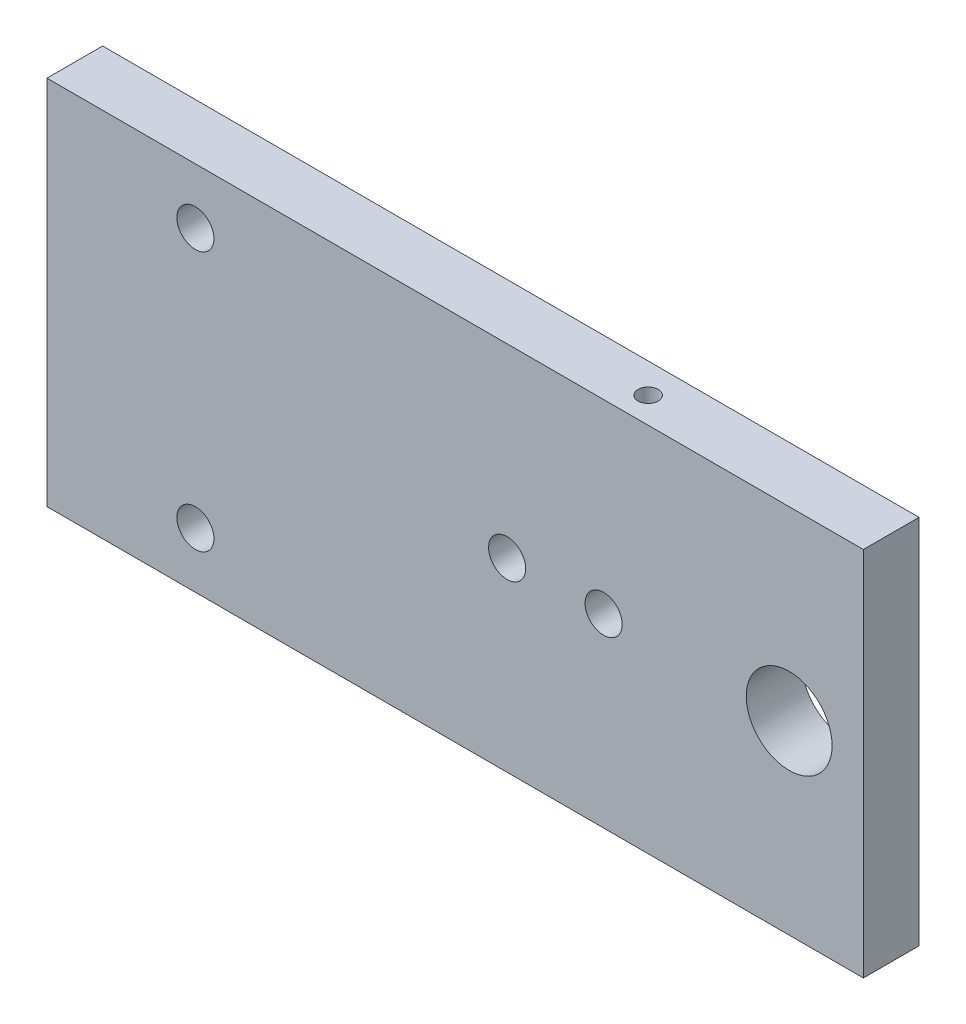
ISO-10303-21;
HEADER;
FILE_DESCRIPTION(('STEP AP214'),'2;1');
FILE_NAME('part.step','',(''),(''),'','','');
FILE_SCHEMA(('AUTOMOTIVE_DESIGN { 1 0 10303 214 1 1 1 1 }'));
ENDSEC;
DATA;
#1=APPLICATION_CONTEXT('core data for automotive mechanical design processes');
#2=APPLICATION_PROTOCOL_DEFINITION('international standard','automotive_design',2000,#1);
#3=PRODUCT_CONTEXT('',#1,'mechanical');
#4=PRODUCT('Part','Part','',(#3));
#5=PRODUCT_RELATED_PRODUCT_CATEGORY('part','',(#4));
#6=PRODUCT_DEFINITION_FORMATION('','',#4);
#7=PRODUCT_DEFINITION_CONTEXT('part definition',#1,'design');
#8=PRODUCT_DEFINITION('design','',#6,#7);
#9=PRODUCT_DEFINITION_SHAPE('','',#8);
#10=(LENGTH_UNIT() NAMED_UNIT(*) SI_UNIT(.MILLI.,.METRE.));
#11=(NAMED_UNIT(*) PLANE_ANGLE_UNIT() SI_UNIT($,.RADIAN.));
#12=(NAMED_UNIT(*) SI_UNIT($,.STERADIAN.) SOLID_ANGLE_UNIT());
#13=UNCERTAINTY_MEASURE_WITH_UNIT(LENGTH_MEASURE(1.E-05),#10,'distance_accuracy_value','');
#14=(GEOMETRIC_REPRESENTATION_CONTEXT(3) GLOBAL_UNCERTAINTY_ASSIGNED_CONTEXT((#13)) GLOBAL_UNIT_ASSIGNED_CONTEXT((#10,
#11,#12)) REPRESENTATION_CONTEXT('',''));
#15=CARTESIAN_POINT('',(0.,0.,0.));
#16=DIRECTION('',(0.,0.,1.));
#17=DIRECTION('',(1.,0.,0.));
#18=AXIS2_PLACEMENT_3D('',#15,#16,#17);
#19=CARTESIAN_POINT('',(0.,0.,9.525));
#20=DIRECTION('',(1.,0.,0.));
#21=DIRECTION('',(0.,0.,-1.));
#22=AXIS2_PLACEMENT_3D('',#19,#20,#21);
#23=PLANE('',#22);
#24=DIRECTION('',(0.,-1.,0.));
#25=VECTOR('',#24,1.);
#26=CARTESIAN_POINT('',(0.,0.,0.));
#27=LINE('',#26,#25);
#28=CARTESIAN_POINT('',(0.,63.5,0.));
#29=VERTEX_POINT('',#28);
#30=CARTESIAN_POINT('',(0.,0.,0.));
#31=VERTEX_POINT('',#30);
#32=EDGE_CURVE('E137',#29,#31,#27,.T.);
#33=ORIENTED_EDGE('',*,*,#32,.T.);
#34=DIRECTION('',(0.,0.,-1.));
#35=VECTOR('',#34,1.);
#36=CARTESIAN_POINT('',(0.,0.,9.525));
#37=LINE('',#36,#35);
#38=CARTESIAN_POINT('',(0.,0.,9.525));
#39=VERTEX_POINT('',#38);
#40=EDGE_CURVE('E11',#39,#31,#37,.T.);
#41=ORIENTED_EDGE('',*,*,#40,.F.);
#42=DIRECTION('',(0.,-1.,0.));
#43=VECTOR('',#42,1.);
#44=CARTESIAN_POINT('',(0.,0.,9.525));
#45=LINE('',#44,#43);
#46=CARTESIAN_POINT('',(0.,63.5,9.525));
#47=VERTEX_POINT('',#46);
#48=EDGE_CURVE('E138',#47,#39,#45,.T.);
#49=ORIENTED_EDGE('',*,*,#48,.F.);
#50=DIRECTION('',(0.,0.,-1.));
#51=VECTOR('',#50,1.);
#52=CARTESIAN_POINT('',(0.,63.5,9.525));
#53=LINE('',#52,#51);
#54=EDGE_CURVE('E148',#47,#29,#53,.T.);
#55=ORIENTED_EDGE('',*,*,#54,.T.);
#56=EDGE_LOOP('',(#33,#41,#49,#55));
#57=FACE_BOUND('',#56,.T.);
#58=ADVANCED_FACE('F42',(#57),#23,.F.);
#59=CARTESIAN_POINT('',(0.,0.,9.525));
#60=DIRECTION('',(0.,1.,0.));
#61=DIRECTION('',(0.,0.,1.));
#62=AXIS2_PLACEMENT_3D('',#59,#60,#61);
#63=PLANE('',#62);
#64=DIRECTION('',(1.,0.,0.));
#65=VECTOR('',#64,1.);
#66=CARTESIAN_POINT('',(0.,0.,0.));
#67=LINE('',#66,#65);
#68=CARTESIAN_POINT('',(139.7,0.,0.));
#69=VERTEX_POINT('',#68);
#70=EDGE_CURVE('E152',#31,#69,#67,.T.);
#71=ORIENTED_EDGE('',*,*,#70,.T.);
#72=DIRECTION('',(0.,0.,-1.));
#73=VECTOR('',#72,1.);
#74=CARTESIAN_POINT('',(139.7,0.,9.525));
#75=LINE('',#74,#73);
#76=CARTESIAN_POINT('',(139.7,0.,9.525));
#77=VERTEX_POINT('',#76);
#78=EDGE_CURVE('E51',#77,#69,#75,.T.);
#79=ORIENTED_EDGE('',*,*,#78,.F.);
#80=DIRECTION('',(1.,0.,0.));
#81=VECTOR('',#80,1.);
#82=CARTESIAN_POINT('',(0.,0.,9.525));
#83=LINE('',#82,#81);
#84=EDGE_CURVE('E90',#39,#77,#83,.T.);
#85=ORIENTED_EDGE('',*,*,#84,.F.);
#86=ORIENTED_EDGE('',*,*,#40,.T.);
#87=EDGE_LOOP('',(#71,#79,#85,#86));
#88=FACE_BOUND('',#87,.T.);
#89=ADVANCED_FACE('F184',(#88),#63,.F.);
#90=CARTESIAN_POINT('',(139.7,0.,9.525));
#91=DIRECTION('',(-1.,0.,0.));
#92=DIRECTION('',(0.,0.,1.));
#93=AXIS2_PLACEMENT_3D('',#90,#91,#92);
#94=PLANE('',#93);
#95=DIRECTION('',(0.,1.,0.));
#96=VECTOR('',#95,1.);
#97=CARTESIAN_POINT('',(139.7,0.,0.));
#98=LINE('',#97,#96);
#99=CARTESIAN_POINT('',(139.7,63.5,0.));
#100=VERTEX_POINT('',#99);
#101=EDGE_CURVE('E77',#69,#100,#98,.T.);
#102=ORIENTED_EDGE('',*,*,#101,.T.);
#103=DIRECTION('',(0.,0.,-1.));
#104=VECTOR('',#103,1.);
#105=CARTESIAN_POINT('',(139.7,63.5,9.525));
#106=LINE('',#105,#104);
#107=CARTESIAN_POINT('',(139.7,63.5,9.525));
#108=VERTEX_POINT('',#107);
#109=EDGE_CURVE('E161',#108,#100,#106,.T.);
#110=ORIENTED_EDGE('',*,*,#109,.F.);
#111=DIRECTION('',(0.,1.,0.));
#112=VECTOR('',#111,1.);
#113=CARTESIAN_POINT('',(139.7,0.,9.525));
#114=LINE('',#113,#112);
#115=EDGE_CURVE('E143',#77,#108,#114,.T.);
#116=ORIENTED_EDGE('',*,*,#115,.F.);
#117=ORIENTED_EDGE('',*,*,#78,.T.);
#118=EDGE_LOOP('',(#102,#110,#116,#117));
#119=FACE_BOUND('',#118,.T.);
#120=ADVANCED_FACE('F165',(#119),#94,.F.);
#121=CARTESIAN_POINT('',(0.,63.5,9.525));
#122=DIRECTION('',(0.,-1.,0.));
#123=DIRECTION('',(0.,0.,-1.));
#124=AXIS2_PLACEMENT_3D('',#121,#122,#123);
#125=PLANE('',#124);
#126=CARTESIAN_POINT('',(98.425,63.5,5.08));
#127=DIRECTION('',(0.,1.,0.));
#128=DIRECTION('',(0.,0.,1.));
#129=AXIS2_PLACEMENT_3D('',#126,#127,#128);
#130=CIRCLE('',#129,1.7272);
#131=CARTESIAN_POINT('',(98.425,63.5,6.8072));
#132=VERTEX_POINT('',#131);
#133=EDGE_CURVE('E106',#132,#132,#130,.T.);
#134=ORIENTED_EDGE('',*,*,#133,.F.);
#135=EDGE_LOOP('',(#134));
#136=FACE_BOUND('',#135,.T.);
#137=DIRECTION('',(-1.,0.,0.));
#138=VECTOR('',#137,1.);
#139=CARTESIAN_POINT('',(0.,63.5,0.));
#140=LINE('',#139,#138);
#141=EDGE_CURVE('E83',#100,#29,#140,.T.);
#142=ORIENTED_EDGE('',*,*,#141,.T.);
#143=ORIENTED_EDGE('',*,*,#54,.F.);
#144=DIRECTION('',(-1.,0.,0.));
#145=VECTOR('',#144,1.);
#146=CARTESIAN_POINT('',(0.,63.5,9.525));
#147=LINE('',#146,#145);
#148=EDGE_CURVE('E59',#108,#47,#147,.T.);
#149=ORIENTED_EDGE('',*,*,#148,.F.);
#150=ORIENTED_EDGE('',*,*,#109,.T.);
#151=EDGE_LOOP('',(#142,#143,#149,#150));
#152=FACE_BOUND('',#151,.T.);
#153=ADVANCED_FACE('F172',(#136,#152),#125,.F.);
#154=CARTESIAN_POINT('',(0.,0.,9.525));
#155=DIRECTION('',(0.,0.,-1.));
#156=DIRECTION('',(-1.,0.,0.));
#157=AXIS2_PLACEMENT_3D('',#154,#155,#156);
#158=PLANE('',#157);
#159=CARTESIAN_POINT('',(95.25,31.75,9.525));
#160=DIRECTION('',(0.,0.,1.));
#161=DIRECTION('',(1.,0.,0.));
#162=AXIS2_PLACEMENT_3D('',#159,#160,#161);
#163=CIRCLE('',#162,3.175);
#164=CARTESIAN_POINT('',(98.425,31.75,9.525));
#165=VERTEX_POINT('',#164);
#166=EDGE_CURVE('E292',#165,#165,#163,.T.);
#167=ORIENTED_EDGE('',*,*,#166,.F.);
#168=EDGE_LOOP('',(#167));
#169=FACE_BOUND('',#168,.T.);
#170=CARTESIAN_POINT('',(78.74,31.75,9.525));
#171=DIRECTION('',(0.,0.,1.));
#172=DIRECTION('',(1.,0.,0.));
#173=AXIS2_PLACEMENT_3D('',#170,#171,#172);
#174=CIRCLE('',#173,3.175);
#175=CARTESIAN_POINT('',(81.915,31.75,9.525));
#176=VERTEX_POINT('',#175);
#177=EDGE_CURVE('E300',#176,#176,#174,.T.);
#178=ORIENTED_EDGE('',*,*,#177,.F.);
#179=EDGE_LOOP('',(#178));
#180=FACE_BOUND('',#179,.T.);
#181=CARTESIAN_POINT('',(25.4,53.975,9.525));
#182=DIRECTION('',(0.,0.,1.));
#183=DIRECTION('',(1.,0.,0.));
#184=AXIS2_PLACEMENT_3D('',#181,#182,#183);
#185=CIRCLE('',#184,3.175);
#186=CARTESIAN_POINT('',(28.575,53.975,9.525));
#187=VERTEX_POINT('',#186);
#188=EDGE_CURVE('E105',#187,#187,#185,.T.);
#189=ORIENTED_EDGE('',*,*,#188,.F.);
#190=EDGE_LOOP('',(#189));
#191=FACE_BOUND('',#190,.T.);
#192=CARTESIAN_POINT('',(25.4,9.525,9.525));
#193=DIRECTION('',(0.,0.,1.));
#194=DIRECTION('',(1.,0.,0.));
#195=AXIS2_PLACEMENT_3D('',#192,#193,#194);
#196=CIRCLE('',#195,3.175);
#197=CARTESIAN_POINT('',(28.575,9.525,9.525));
#198=VERTEX_POINT('',#197);
#199=EDGE_CURVE('E121',#198,#198,#196,.T.);
#200=ORIENTED_EDGE('',*,*,#199,.F.);
#201=EDGE_LOOP('',(#200));
#202=FACE_BOUND('',#201,.T.);
#203=CARTESIAN_POINT('',(127.,31.75,9.525));
#204=DIRECTION('',(0.,0.,1.));
#205=DIRECTION('',(1.,0.,0.));
#206=AXIS2_PLACEMENT_3D('',#203,#204,#205);
#207=CIRCLE('',#206,7.34187);
#208=CARTESIAN_POINT('',(134.34187,31.75,9.525));
#209=VERTEX_POINT('',#208);
#210=EDGE_CURVE('E129',#209,#209,#207,.T.);
#211=ORIENTED_EDGE('',*,*,#210,.F.);
#212=EDGE_LOOP('',(#211));
#213=FACE_BOUND('',#212,.T.);
#214=ORIENTED_EDGE('',*,*,#48,.T.);
#215=ORIENTED_EDGE('',*,*,#84,.T.);
#216=ORIENTED_EDGE('',*,*,#115,.T.);
#217=ORIENTED_EDGE('',*,*,#148,.T.);
#218=EDGE_LOOP('',(#214,#215,#216,#217));
#219=FACE_BOUND('',#218,.T.);
#220=ADVANCED_FACE('F174',(#169,#180,#191,#202,#213,#219),#158,.F.);
#221=CARTESIAN_POINT('',(0.,0.,0.));
#222=DIRECTION('',(0.,0.,-1.));
#223=DIRECTION('',(-1.,0.,0.));
#224=AXIS2_PLACEMENT_3D('',#221,#222,#223);
#225=PLANE('',#224);
#226=CARTESIAN_POINT('',(95.25,31.75,0.));
#227=DIRECTION('',(0.,0.,1.));
#228=DIRECTION('',(1.,0.,0.));
#229=AXIS2_PLACEMENT_3D('',#226,#227,#228);
#230=CIRCLE('',#229,3.175);
#231=CARTESIAN_POINT('',(98.425,31.75,0.));
#232=VERTEX_POINT('',#231);
#233=EDGE_CURVE('E114',#232,#232,#230,.T.);
#234=ORIENTED_EDGE('',*,*,#233,.T.);
#235=EDGE_LOOP('',(#234));
#236=FACE_BOUND('',#235,.T.);
#237=CARTESIAN_POINT('',(78.74,31.75,0.));
#238=DIRECTION('',(0.,0.,1.));
#239=DIRECTION('',(1.,0.,0.));
#240=AXIS2_PLACEMENT_3D('',#237,#238,#239);
#241=CIRCLE('',#240,3.175);
#242=CARTESIAN_POINT('',(81.915,31.75,0.));
#243=VERTEX_POINT('',#242);
#244=EDGE_CURVE('E294',#243,#243,#241,.T.);
#245=ORIENTED_EDGE('',*,*,#244,.T.);
#246=EDGE_LOOP('',(#245));
#247=FACE_BOUND('',#246,.T.);
#248=CARTESIAN_POINT('',(25.4,53.975,0.));
#249=DIRECTION('',(0.,0.,1.));
#250=DIRECTION('',(1.,0.,0.));
#251=AXIS2_PLACEMENT_3D('',#248,#249,#250);
#252=CIRCLE('',#251,3.175);
#253=CARTESIAN_POINT('',(28.575,53.975,0.));
#254=VERTEX_POINT('',#253);
#255=EDGE_CURVE('E111',#254,#254,#252,.T.);
#256=ORIENTED_EDGE('',*,*,#255,.T.);
#257=EDGE_LOOP('',(#256));
#258=FACE_BOUND('',#257,.T.);
#259=CARTESIAN_POINT('',(25.4,9.525,0.));
#260=DIRECTION('',(0.,0.,1.));
#261=DIRECTION('',(1.,0.,0.));
#262=AXIS2_PLACEMENT_3D('',#259,#260,#261);
#263=CIRCLE('',#262,3.175);
#264=CARTESIAN_POINT('',(28.575,9.525,0.));
#265=VERTEX_POINT('',#264);
#266=EDGE_CURVE('E125',#265,#265,#263,.T.);
#267=ORIENTED_EDGE('',*,*,#266,.T.);
#268=EDGE_LOOP('',(#267));
#269=FACE_BOUND('',#268,.T.);
#270=CARTESIAN_POINT('',(127.,31.75,0.));
#271=DIRECTION('',(0.,0.,1.));
#272=DIRECTION('',(1.,0.,0.));
#273=AXIS2_PLACEMENT_3D('',#270,#271,#272);
#274=CIRCLE('',#273,7.34187);
#275=CARTESIAN_POINT('',(134.34187,31.75,0.));
#276=VERTEX_POINT('',#275);
#277=EDGE_CURVE('E133',#276,#276,#274,.T.);
#278=ORIENTED_EDGE('',*,*,#277,.T.);
#279=EDGE_LOOP('',(#278));
#280=FACE_BOUND('',#279,.T.);
#281=ORIENTED_EDGE('',*,*,#32,.F.);
#282=ORIENTED_EDGE('',*,*,#141,.F.);
#283=ORIENTED_EDGE('',*,*,#101,.F.);
#284=ORIENTED_EDGE('',*,*,#70,.F.);
#285=EDGE_LOOP('',(#281,#282,#283,#284));
#286=FACE_BOUND('',#285,.T.);
#287=ADVANCED_FACE('F168',(#236,#247,#258,#269,#280,#286),#225,.T.);
#288=CARTESIAN_POINT('',(127.,31.75,9.525));
#289=DIRECTION('',(0.,0.,1.));
#290=DIRECTION('',(1.,0.,0.));
#291=AXIS2_PLACEMENT_3D('',#288,#289,#290);
#292=CYLINDRICAL_SURFACE('',#291,7.34187);
#293=ORIENTED_EDGE('',*,*,#277,.F.);
#294=EDGE_LOOP('',(#293));
#295=FACE_BOUND('',#294,.T.);
#296=ORIENTED_EDGE('',*,*,#210,.T.);
#297=EDGE_LOOP('',(#296));
#298=FACE_BOUND('',#297,.T.);
#299=ADVANCED_FACE('F204',(#295,#298),#292,.F.);
#300=CARTESIAN_POINT('',(25.4,9.525,9.525));
#301=DIRECTION('',(0.,0.,1.));
#302=DIRECTION('',(1.,0.,0.));
#303=AXIS2_PLACEMENT_3D('',#300,#301,#302);
#304=CYLINDRICAL_SURFACE('',#303,3.175);
#305=ORIENTED_EDGE('',*,*,#266,.F.);
#306=EDGE_LOOP('',(#305));
#307=FACE_BOUND('',#306,.T.);
#308=ORIENTED_EDGE('',*,*,#199,.T.);
#309=EDGE_LOOP('',(#308));
#310=FACE_BOUND('',#309,.T.);
#311=ADVANCED_FACE('F210',(#307,#310),#304,.F.);
#312=CARTESIAN_POINT('',(25.4,53.975,9.525));
#313=DIRECTION('',(0.,0.,1.));
#314=DIRECTION('',(1.,0.,0.));
#315=AXIS2_PLACEMENT_3D('',#312,#313,#314);
#316=CYLINDRICAL_SURFACE('',#315,3.175);
#317=ORIENTED_EDGE('',*,*,#255,.F.);
#318=EDGE_LOOP('',(#317));
#319=FACE_BOUND('',#318,.T.);
#320=ORIENTED_EDGE('',*,*,#188,.T.);
#321=EDGE_LOOP('',(#320));
#322=FACE_BOUND('',#321,.T.);
#323=ADVANCED_FACE('F98',(#319,#322),#316,.F.);
#324=CARTESIAN_POINT('',(98.425,50.8,5.08));
#325=DIRECTION('',(0.,1.,0.));
#326=DIRECTION('',(0.,0.,1.));
#327=AXIS2_PLACEMENT_3D('',#324,#325,#326);
#328=CONICAL_SURFACE('',#327,1.7272,1.02974425867666);
#329=CARTESIAN_POINT('',(98.425,49.7621935388156,5.08));
#330=VERTEX_POINT('',#329);
#331=VERTEX_LOOP('',#330);
#332=FACE_BOUND('',#331,.T.);
#333=CARTESIAN_POINT('',(98.425,50.8,5.08));
#334=DIRECTION('',(0.,1.,0.));
#335=DIRECTION('',(0.,0.,1.));
#336=AXIS2_PLACEMENT_3D('',#333,#334,#335);
#337=CIRCLE('',#336,1.7272);
#338=CARTESIAN_POINT('',(98.425,50.8,6.8072));
#339=VERTEX_POINT('',#338);
#340=EDGE_CURVE('E102',#339,#339,#337,.T.);
#341=ORIENTED_EDGE('',*,*,#340,.T.);
#342=EDGE_LOOP('',(#341));
#343=FACE_BOUND('',#342,.T.);
#344=ADVANCED_FACE('F94',(#332,#343),#328,.F.);
#345=CARTESIAN_POINT('',(98.425,63.5,5.08));
#346=DIRECTION('',(0.,1.,0.));
#347=DIRECTION('',(0.,0.,1.));
#348=AXIS2_PLACEMENT_3D('',#345,#346,#347);
#349=CYLINDRICAL_SURFACE('',#348,1.7272);
#350=ORIENTED_EDGE('',*,*,#340,.F.);
#351=EDGE_LOOP('',(#350));
#352=FACE_BOUND('',#351,.T.);
#353=ORIENTED_EDGE('',*,*,#133,.T.);
#354=EDGE_LOOP('',(#353));
#355=FACE_BOUND('',#354,.T.);
#356=ADVANCED_FACE('F97',(#352,#355),#349,.F.);
#357=CARTESIAN_POINT('',(78.74,31.75,0.));
#358=DIRECTION('',(0.,0.,1.));
#359=DIRECTION('',(1.,0.,0.));
#360=AXIS2_PLACEMENT_3D('',#357,#358,#359);
#361=CYLINDRICAL_SURFACE('',#360,3.175);
#362=ORIENTED_EDGE('',*,*,#244,.F.);
#363=EDGE_LOOP('',(#362));
#364=FACE_BOUND('',#363,.T.);
#365=ORIENTED_EDGE('',*,*,#177,.T.);
#366=EDGE_LOOP('',(#365));
#367=FACE_BOUND('',#366,.T.);
#368=ADVANCED_FACE('F255',(#364,#367),#361,.F.);
#369=CARTESIAN_POINT('',(95.25,31.75,0.));
#370=DIRECTION('',(0.,0.,1.));
#371=DIRECTION('',(1.,0.,0.));
#372=AXIS2_PLACEMENT_3D('',#369,#370,#371);
#373=CYLINDRICAL_SURFACE('',#372,3.175);
#374=ORIENTED_EDGE('',*,*,#233,.F.);
#375=EDGE_LOOP('',(#374));
#376=FACE_BOUND('',#375,.T.);
#377=ORIENTED_EDGE('',*,*,#166,.T.);
#378=EDGE_LOOP('',(#377));
#379=FACE_BOUND('',#378,.T.);
#380=ADVANCED_FACE('F273',(#376,#379),#373,.F.);
#381=CLOSED_SHELL('',(#58,#89,#120,#153,#220,#287,#299,#311,#323,#344,#356,#368,#380));
#382=MANIFOLD_SOLID_BREP('B2',#381);
#383=ADVANCED_BREP_SHAPE_REPRESENTATION('',(#18,#382),#14);
#384=SHAPE_DEFINITION_REPRESENTATION(#9,#383);
ENDSEC;
END-ISO-10303-21;
